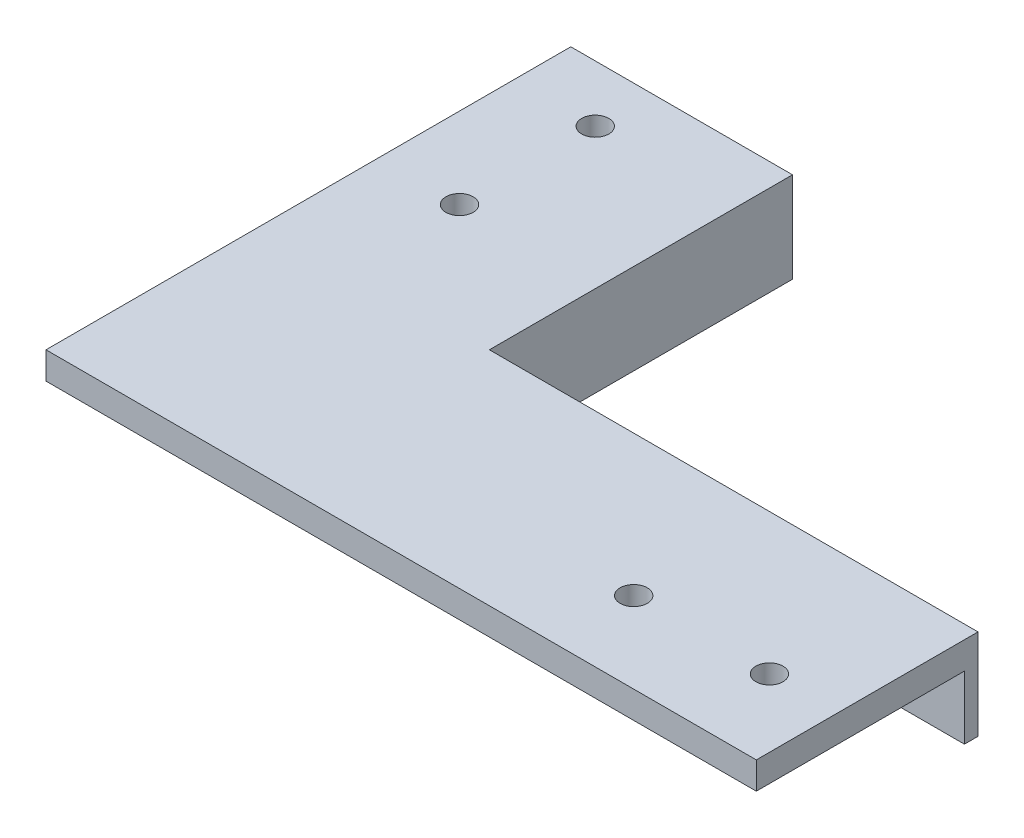
ISO-10303-21;
HEADER;
FILE_DESCRIPTION(('STEP AP214'),'2;1');
FILE_NAME('part.step','',(''),(''),'','','');
FILE_SCHEMA(('AUTOMOTIVE_DESIGN { 1 0 10303 214 1 1 1 1 }'));
ENDSEC;
DATA;
#1=APPLICATION_CONTEXT('core data for automotive mechanical design processes');
#2=APPLICATION_PROTOCOL_DEFINITION('international standard','automotive_design',2000,#1);
#3=PRODUCT_CONTEXT('',#1,'mechanical');
#4=PRODUCT('Part','Part','',(#3));
#5=PRODUCT_RELATED_PRODUCT_CATEGORY('part','',(#4));
#6=PRODUCT_DEFINITION_FORMATION('','',#4);
#7=PRODUCT_DEFINITION_CONTEXT('part definition',#1,'design');
#8=PRODUCT_DEFINITION('design','',#6,#7);
#9=PRODUCT_DEFINITION_SHAPE('','',#8);
#10=(LENGTH_UNIT() NAMED_UNIT(*) SI_UNIT(.MILLI.,.METRE.));
#11=(NAMED_UNIT(*) PLANE_ANGLE_UNIT() SI_UNIT($,.RADIAN.));
#12=(NAMED_UNIT(*) SI_UNIT($,.STERADIAN.) SOLID_ANGLE_UNIT());
#13=UNCERTAINTY_MEASURE_WITH_UNIT(LENGTH_MEASURE(1.E-05),#10,'distance_accuracy_value','');
#14=(GEOMETRIC_REPRESENTATION_CONTEXT(3) GLOBAL_UNCERTAINTY_ASSIGNED_CONTEXT((#13)) GLOBAL_UNIT_ASSIGNED_CONTEXT((#10,
#11,#12)) REPRESENTATION_CONTEXT('',''));
#15=CARTESIAN_POINT('',(0.,0.,0.));
#16=DIRECTION('',(0.,0.,1.));
#17=DIRECTION('',(1.,0.,0.));
#18=AXIS2_PLACEMENT_3D('',#15,#16,#17);
#19=CARTESIAN_POINT('',(-39.25,3.,29.));
#20=DIRECTION('',(0.,0.,-1.));
#21=DIRECTION('',(-1.,0.,0.));
#22=AXIS2_PLACEMENT_3D('',#19,#20,#21);
#23=PLANE('',#22);
#24=DIRECTION('',(1.,0.,0.));
#25=VECTOR('',#24,1.);
#26=CARTESIAN_POINT('',(-39.25,0.,29.));
#27=LINE('',#26,#25);
#28=CARTESIAN_POINT('',(-39.25,0.,29.));
#29=VERTEX_POINT('',#28);
#30=CARTESIAN_POINT('',(39.25,0.,29.));
#31=VERTEX_POINT('',#30);
#32=EDGE_CURVE('E182',#29,#31,#27,.T.);
#33=ORIENTED_EDGE('',*,*,#32,.T.);
#34=DIRECTION('',(0.,-1.,0.));
#35=VECTOR('',#34,1.);
#36=CARTESIAN_POINT('',(39.25,3.,29.));
#37=LINE('',#36,#35);
#38=CARTESIAN_POINT('',(39.25,3.,29.));
#39=VERTEX_POINT('',#38);
#40=EDGE_CURVE('E11',#39,#31,#37,.T.);
#41=ORIENTED_EDGE('',*,*,#40,.F.);
#42=DIRECTION('',(1.,0.,0.));
#43=VECTOR('',#42,1.);
#44=CARTESIAN_POINT('',(-39.25,3.,29.));
#45=LINE('',#44,#43);
#46=CARTESIAN_POINT('',(-39.25,3.,29.));
#47=VERTEX_POINT('',#46);
#48=EDGE_CURVE('E185',#47,#39,#45,.T.);
#49=ORIENTED_EDGE('',*,*,#48,.F.);
#50=DIRECTION('',(0.,-1.,0.));
#51=VECTOR('',#50,1.);
#52=CARTESIAN_POINT('',(-39.25,3.,29.));
#53=LINE('',#52,#51);
#54=EDGE_CURVE('E191',#47,#29,#53,.T.);
#55=ORIENTED_EDGE('',*,*,#54,.T.);
#56=EDGE_LOOP('',(#33,#41,#49,#55));
#57=FACE_BOUND('',#56,.T.);
#58=ADVANCED_FACE('F32',(#57),#23,.F.);
#59=CARTESIAN_POINT('',(39.25,3.,29.));
#60=DIRECTION('',(-1.,0.,0.));
#61=DIRECTION('',(0.,0.,1.));
#62=AXIS2_PLACEMENT_3D('',#59,#60,#61);
#63=PLANE('',#62);
#64=DIRECTION('',(0.,0.,-1.));
#65=VECTOR('',#64,1.);
#66=CARTESIAN_POINT('',(39.25,0.,29.));
#67=LINE('',#66,#65);
#68=CARTESIAN_POINT('',(39.25,0.,6.));
#69=VERTEX_POINT('',#68);
#70=EDGE_CURVE('E194',#31,#69,#67,.T.);
#71=ORIENTED_EDGE('',*,*,#70,.T.);
#72=DIRECTION('',(0.,1.,0.));
#73=VECTOR('',#72,1.);
#74=CARTESIAN_POINT('',(39.25,-7.,6.));
#75=LINE('',#74,#73);
#76=CARTESIAN_POINT('',(39.25,-7.,6.));
#77=VERTEX_POINT('',#76);
#78=EDGE_CURVE('E157',#77,#69,#75,.T.);
#79=ORIENTED_EDGE('',*,*,#78,.F.);
#80=DIRECTION('',(0.,0.,-1.));
#81=VECTOR('',#80,1.);
#82=CARTESIAN_POINT('',(39.25,-7.,6.));
#83=LINE('',#82,#81);
#84=CARTESIAN_POINT('',(39.25,-7.,4.5));
#85=VERTEX_POINT('',#84);
#86=EDGE_CURVE('E142',#77,#85,#83,.T.);
#87=ORIENTED_EDGE('',*,*,#86,.T.);
#88=DIRECTION('',(0.,1.,0.));
#89=VECTOR('',#88,1.);
#90=CARTESIAN_POINT('',(39.25,-7.,4.5));
#91=LINE('',#90,#89);
#92=CARTESIAN_POINT('',(39.25,3.,4.5));
#93=VERTEX_POINT('',#92);
#94=EDGE_CURVE('E155',#85,#93,#91,.T.);
#95=ORIENTED_EDGE('',*,*,#94,.T.);
#96=DIRECTION('',(0.,0.,-1.));
#97=VECTOR('',#96,1.);
#98=CARTESIAN_POINT('',(39.25,3.,29.));
#99=LINE('',#98,#97);
#100=EDGE_CURVE('E80',#39,#93,#99,.T.);
#101=ORIENTED_EDGE('',*,*,#100,.F.);
#102=ORIENTED_EDGE('',*,*,#40,.T.);
#103=EDGE_LOOP('',(#71,#79,#87,#95,#101,#102));
#104=FACE_BOUND('',#103,.T.);
#105=ADVANCED_FACE('F213',(#104),#63,.F.);
#106=CARTESIAN_POINT('',(-16.25,3.,-29.));
#107=DIRECTION('',(0.,0.,1.));
#108=DIRECTION('',(1.,0.,0.));
#109=AXIS2_PLACEMENT_3D('',#106,#107,#108);
#110=PLANE('',#109);
#111=DIRECTION('',(-1.,0.,0.));
#112=VECTOR('',#111,1.);
#113=CARTESIAN_POINT('',(-16.25,0.,-29.));
#114=LINE('',#113,#112);
#115=CARTESIAN_POINT('',(-16.25,0.,-29.));
#116=VERTEX_POINT('',#115);
#117=CARTESIAN_POINT('',(-39.25,0.,-29.));
#118=VERTEX_POINT('',#117);
#119=EDGE_CURVE('E69',#116,#118,#114,.T.);
#120=ORIENTED_EDGE('',*,*,#119,.T.);
#121=DIRECTION('',(0.,-1.,0.));
#122=VECTOR('',#121,1.);
#123=CARTESIAN_POINT('',(-39.25,3.,-29.));
#124=LINE('',#123,#122);
#125=CARTESIAN_POINT('',(-39.25,3.,-29.));
#126=VERTEX_POINT('',#125);
#127=EDGE_CURVE('E40',#126,#118,#124,.T.);
#128=ORIENTED_EDGE('',*,*,#127,.F.);
#129=DIRECTION('',(-1.,0.,0.));
#130=VECTOR('',#129,1.);
#131=CARTESIAN_POINT('',(-16.25,3.,-29.));
#132=LINE('',#131,#130);
#133=CARTESIAN_POINT('',(-14.75,3.,-29.));
#134=VERTEX_POINT('',#133);
#135=EDGE_CURVE('E188',#134,#126,#132,.T.);
#136=ORIENTED_EDGE('',*,*,#135,.F.);
#137=DIRECTION('',(0.,1.,0.));
#138=VECTOR('',#137,1.);
#139=CARTESIAN_POINT('',(-14.75,-7.,-29.));
#140=LINE('',#139,#138);
#141=CARTESIAN_POINT('',(-14.75,-7.,-29.));
#142=VERTEX_POINT('',#141);
#143=EDGE_CURVE('E134',#142,#134,#140,.T.);
#144=ORIENTED_EDGE('',*,*,#143,.F.);
#145=DIRECTION('',(-1.,0.,0.));
#146=VECTOR('',#145,1.);
#147=CARTESIAN_POINT('',(-14.75,-7.,-29.));
#148=LINE('',#147,#146);
#149=CARTESIAN_POINT('',(-16.25,-7.,-29.));
#150=VERTEX_POINT('',#149);
#151=EDGE_CURVE('E126',#142,#150,#148,.T.);
#152=ORIENTED_EDGE('',*,*,#151,.T.);
#153=DIRECTION('',(0.,1.,0.));
#154=VECTOR('',#153,1.);
#155=CARTESIAN_POINT('',(-16.25,-7.,-29.));
#156=LINE('',#155,#154);
#157=EDGE_CURVE('E111',#150,#116,#156,.T.);
#158=ORIENTED_EDGE('',*,*,#157,.T.);
#159=EDGE_LOOP('',(#120,#128,#136,#144,#152,#158));
#160=FACE_BOUND('',#159,.T.);
#161=ADVANCED_FACE('F132',(#160),#110,.F.);
#162=CARTESIAN_POINT('',(-39.25,3.,-29.));
#163=DIRECTION('',(1.,0.,0.));
#164=DIRECTION('',(0.,0.,-1.));
#165=AXIS2_PLACEMENT_3D('',#162,#163,#164);
#166=PLANE('',#165);
#167=DIRECTION('',(0.,0.,1.));
#168=VECTOR('',#167,1.);
#169=CARTESIAN_POINT('',(-39.25,0.,-29.));
#170=LINE('',#169,#168);
#171=EDGE_CURVE('E74',#118,#29,#170,.T.);
#172=ORIENTED_EDGE('',*,*,#171,.T.);
#173=ORIENTED_EDGE('',*,*,#54,.F.);
#174=DIRECTION('',(0.,0.,1.));
#175=VECTOR('',#174,1.);
#176=CARTESIAN_POINT('',(-39.25,3.,-29.));
#177=LINE('',#176,#175);
#178=EDGE_CURVE('E48',#126,#47,#177,.T.);
#179=ORIENTED_EDGE('',*,*,#178,.F.);
#180=ORIENTED_EDGE('',*,*,#127,.T.);
#181=EDGE_LOOP('',(#172,#173,#179,#180));
#182=FACE_BOUND('',#181,.T.);
#183=ADVANCED_FACE('F202',(#182),#166,.F.);
#184=CARTESIAN_POINT('',(0.,3.,0.));
#185=DIRECTION('',(0.,1.,0.));
#186=DIRECTION('',(0.,0.,1.));
#187=AXIS2_PLACEMENT_3D('',#184,#185,#186);
#188=PLANE('',#187);
#189=CARTESIAN_POINT('',(-30.3,3.,-7.75));
#190=DIRECTION('',(0.,1.,0.));
#191=DIRECTION('',(0.,0.,1.));
#192=AXIS2_PLACEMENT_3D('',#189,#190,#191);
#193=CIRCLE('',#192,1.5);
#194=CARTESIAN_POINT('',(-30.3,3.,-6.25));
#195=VERTEX_POINT('',#194);
#196=EDGE_CURVE('E152',#195,#195,#193,.T.);
#197=ORIENTED_EDGE('',*,*,#196,.F.);
#198=EDGE_LOOP('',(#197));
#199=FACE_BOUND('',#198,.T.);
#200=CARTESIAN_POINT('',(-30.3,3.,-22.75));
#201=DIRECTION('',(0.,1.,0.));
#202=DIRECTION('',(0.,0.,1.));
#203=AXIS2_PLACEMENT_3D('',#200,#201,#202);
#204=CIRCLE('',#203,1.5);
#205=CARTESIAN_POINT('',(-30.3,3.,-21.25));
#206=VERTEX_POINT('',#205);
#207=EDGE_CURVE('E164',#206,#206,#204,.T.);
#208=ORIENTED_EDGE('',*,*,#207,.F.);
#209=EDGE_LOOP('',(#208));
#210=FACE_BOUND('',#209,.T.);
#211=CARTESIAN_POINT('',(16.75,3.,20.05));
#212=DIRECTION('',(0.,1.,0.));
#213=DIRECTION('',(0.,0.,1.));
#214=AXIS2_PLACEMENT_3D('',#211,#212,#213);
#215=CIRCLE('',#214,1.5);
#216=CARTESIAN_POINT('',(16.75,3.,21.55));
#217=VERTEX_POINT('',#216);
#218=EDGE_CURVE('E170',#217,#217,#215,.T.);
#219=ORIENTED_EDGE('',*,*,#218,.F.);
#220=EDGE_LOOP('',(#219));
#221=FACE_BOUND('',#220,.T.);
#222=CARTESIAN_POINT('',(31.75,3.,20.05));
#223=DIRECTION('',(0.,1.,0.));
#224=DIRECTION('',(0.,0.,1.));
#225=AXIS2_PLACEMENT_3D('',#222,#223,#224);
#226=CIRCLE('',#225,1.5);
#227=CARTESIAN_POINT('',(31.75,3.,21.55));
#228=VERTEX_POINT('',#227);
#229=EDGE_CURVE('E176',#228,#228,#226,.T.);
#230=ORIENTED_EDGE('',*,*,#229,.F.);
#231=EDGE_LOOP('',(#230));
#232=FACE_BOUND('',#231,.T.);
#233=ORIENTED_EDGE('',*,*,#48,.T.);
#234=ORIENTED_EDGE('',*,*,#100,.T.);
#235=DIRECTION('',(-1.,0.,0.));
#236=VECTOR('',#235,1.);
#237=CARTESIAN_POINT('',(39.25,3.,4.5));
#238=LINE('',#237,#236);
#239=CARTESIAN_POINT('',(-14.75,3.,4.50000000000001));
#240=VERTEX_POINT('',#239);
#241=EDGE_CURVE('E138',#93,#240,#238,.T.);
#242=ORIENTED_EDGE('',*,*,#241,.T.);
#243=DIRECTION('',(0.,0.,-1.));
#244=VECTOR('',#243,1.);
#245=CARTESIAN_POINT('',(-14.75,3.,4.50000000000001));
#246=LINE('',#245,#244);
#247=EDGE_CURVE('E135',#240,#134,#246,.T.);
#248=ORIENTED_EDGE('',*,*,#247,.T.);
#249=ORIENTED_EDGE('',*,*,#135,.T.);
#250=ORIENTED_EDGE('',*,*,#178,.T.);
#251=EDGE_LOOP('',(#233,#234,#242,#248,#249,#250));
#252=FACE_BOUND('',#251,.T.);
#253=ADVANCED_FACE('F210',(#199,#210,#221,#232,#252),#188,.T.);
#254=CARTESIAN_POINT('',(0.,0.,0.));
#255=DIRECTION('',(0.,1.,0.));
#256=DIRECTION('',(0.,0.,1.));
#257=AXIS2_PLACEMENT_3D('',#254,#255,#256);
#258=PLANE('',#257);
#259=CARTESIAN_POINT('',(-30.3,0.,-7.75));
#260=DIRECTION('',(0.,1.,0.));
#261=DIRECTION('',(0.,0.,1.));
#262=AXIS2_PLACEMENT_3D('',#259,#260,#261);
#263=CIRCLE('',#262,1.5);
#264=CARTESIAN_POINT('',(-30.3,0.,-6.25));
#265=VERTEX_POINT('',#264);
#266=EDGE_CURVE('E161',#265,#265,#263,.T.);
#267=ORIENTED_EDGE('',*,*,#266,.T.);
#268=EDGE_LOOP('',(#267));
#269=FACE_BOUND('',#268,.T.);
#270=CARTESIAN_POINT('',(-30.3,0.,-22.75));
#271=DIRECTION('',(0.,1.,0.));
#272=DIRECTION('',(0.,0.,1.));
#273=AXIS2_PLACEMENT_3D('',#270,#271,#272);
#274=CIRCLE('',#273,1.5);
#275=CARTESIAN_POINT('',(-30.3,0.,-21.25));
#276=VERTEX_POINT('',#275);
#277=EDGE_CURVE('E167',#276,#276,#274,.T.);
#278=ORIENTED_EDGE('',*,*,#277,.T.);
#279=EDGE_LOOP('',(#278));
#280=FACE_BOUND('',#279,.T.);
#281=CARTESIAN_POINT('',(16.75,0.,20.05));
#282=DIRECTION('',(0.,1.,0.));
#283=DIRECTION('',(0.,0.,1.));
#284=AXIS2_PLACEMENT_3D('',#281,#282,#283);
#285=CIRCLE('',#284,1.5);
#286=CARTESIAN_POINT('',(16.75,0.,21.55));
#287=VERTEX_POINT('',#286);
#288=EDGE_CURVE('E173',#287,#287,#285,.T.);
#289=ORIENTED_EDGE('',*,*,#288,.T.);
#290=EDGE_LOOP('',(#289));
#291=FACE_BOUND('',#290,.T.);
#292=CARTESIAN_POINT('',(31.75,0.,20.05));
#293=DIRECTION('',(0.,1.,0.));
#294=DIRECTION('',(0.,0.,1.));
#295=AXIS2_PLACEMENT_3D('',#292,#293,#294);
#296=CIRCLE('',#295,1.5);
#297=CARTESIAN_POINT('',(31.75,0.,21.55));
#298=VERTEX_POINT('',#297);
#299=EDGE_CURVE('E179',#298,#298,#296,.T.);
#300=ORIENTED_EDGE('',*,*,#299,.T.);
#301=EDGE_LOOP('',(#300));
#302=FACE_BOUND('',#301,.T.);
#303=ORIENTED_EDGE('',*,*,#32,.F.);
#304=ORIENTED_EDGE('',*,*,#171,.F.);
#305=ORIENTED_EDGE('',*,*,#119,.F.);
#306=DIRECTION('',(0.,0.,-1.));
#307=VECTOR('',#306,1.);
#308=CARTESIAN_POINT('',(-16.25,0.,-29.));
#309=LINE('',#308,#307);
#310=CARTESIAN_POINT('',(-16.25,0.,6.));
#311=VERTEX_POINT('',#310);
#312=EDGE_CURVE('E116',#311,#116,#309,.T.);
#313=ORIENTED_EDGE('',*,*,#312,.F.);
#314=DIRECTION('',(-1.,0.,0.));
#315=VECTOR('',#314,1.);
#316=CARTESIAN_POINT('',(-16.25,0.,6.));
#317=LINE('',#316,#315);
#318=EDGE_CURVE('E196',#69,#311,#317,.T.);
#319=ORIENTED_EDGE('',*,*,#318,.F.);
#320=ORIENTED_EDGE('',*,*,#70,.F.);
#321=EDGE_LOOP('',(#303,#304,#305,#313,#319,#320));
#322=FACE_BOUND('',#321,.T.);
#323=ADVANCED_FACE('F205',(#269,#280,#291,#302,#322),#258,.F.);
#324=CARTESIAN_POINT('',(31.75,0.,20.05));
#325=DIRECTION('',(0.,1.,0.));
#326=DIRECTION('',(0.,0.,1.));
#327=AXIS2_PLACEMENT_3D('',#324,#325,#326);
#328=CYLINDRICAL_SURFACE('',#327,1.5);
#329=ORIENTED_EDGE('',*,*,#299,.F.);
#330=EDGE_LOOP('',(#329));
#331=FACE_BOUND('',#330,.T.);
#332=ORIENTED_EDGE('',*,*,#229,.T.);
#333=EDGE_LOOP('',(#332));
#334=FACE_BOUND('',#333,.T.);
#335=ADVANCED_FACE('F246',(#331,#334),#328,.F.);
#336=CARTESIAN_POINT('',(16.75,0.,20.05));
#337=DIRECTION('',(0.,1.,0.));
#338=DIRECTION('',(0.,0.,1.));
#339=AXIS2_PLACEMENT_3D('',#336,#337,#338);
#340=CYLINDRICAL_SURFACE('',#339,1.5);
#341=ORIENTED_EDGE('',*,*,#288,.F.);
#342=EDGE_LOOP('',(#341));
#343=FACE_BOUND('',#342,.T.);
#344=ORIENTED_EDGE('',*,*,#218,.T.);
#345=EDGE_LOOP('',(#344));
#346=FACE_BOUND('',#345,.T.);
#347=ADVANCED_FACE('F253',(#343,#346),#340,.F.);
#348=CARTESIAN_POINT('',(-30.3,0.,-22.75));
#349=DIRECTION('',(0.,1.,0.));
#350=DIRECTION('',(0.,0.,1.));
#351=AXIS2_PLACEMENT_3D('',#348,#349,#350);
#352=CYLINDRICAL_SURFACE('',#351,1.5);
#353=ORIENTED_EDGE('',*,*,#277,.F.);
#354=EDGE_LOOP('',(#353));
#355=FACE_BOUND('',#354,.T.);
#356=ORIENTED_EDGE('',*,*,#207,.T.);
#357=EDGE_LOOP('',(#356));
#358=FACE_BOUND('',#357,.T.);
#359=ADVANCED_FACE('F229',(#355,#358),#352,.F.);
#360=CARTESIAN_POINT('',(-30.3,0.,-7.75));
#361=DIRECTION('',(0.,1.,0.));
#362=DIRECTION('',(0.,0.,1.));
#363=AXIS2_PLACEMENT_3D('',#360,#361,#362);
#364=CYLINDRICAL_SURFACE('',#363,1.5);
#365=ORIENTED_EDGE('',*,*,#266,.F.);
#366=EDGE_LOOP('',(#365));
#367=FACE_BOUND('',#366,.T.);
#368=ORIENTED_EDGE('',*,*,#196,.T.);
#369=EDGE_LOOP('',(#368));
#370=FACE_BOUND('',#369,.T.);
#371=ADVANCED_FACE('F222',(#367,#370),#364,.F.);
#372=CARTESIAN_POINT('',(-16.25,-7.,6.));
#373=DIRECTION('',(0.,0.,1.));
#374=DIRECTION('',(1.,0.,0.));
#375=AXIS2_PLACEMENT_3D('',#372,#373,#374);
#376=PLANE('',#375);
#377=ORIENTED_EDGE('',*,*,#318,.T.);
#378=DIRECTION('',(0.,1.,0.));
#379=VECTOR('',#378,1.);
#380=CARTESIAN_POINT('',(-16.25,-7.,6.));
#381=LINE('',#380,#379);
#382=CARTESIAN_POINT('',(-16.25,-7.,6.));
#383=VERTEX_POINT('',#382);
#384=EDGE_CURVE('E118',#383,#311,#381,.T.);
#385=ORIENTED_EDGE('',*,*,#384,.F.);
#386=DIRECTION('',(1.,0.,0.));
#387=VECTOR('',#386,1.);
#388=CARTESIAN_POINT('',(-16.25,-7.,6.));
#389=LINE('',#388,#387);
#390=EDGE_CURVE('E130',#383,#77,#389,.T.);
#391=ORIENTED_EDGE('',*,*,#390,.T.);
#392=ORIENTED_EDGE('',*,*,#78,.T.);
#393=EDGE_LOOP('',(#377,#385,#391,#392));
#394=FACE_BOUND('',#393,.T.);
#395=ADVANCED_FACE('F220',(#394),#376,.T.);
#396=CARTESIAN_POINT('',(-16.25,-7.,-29.));
#397=DIRECTION('',(-1.,0.,0.));
#398=DIRECTION('',(0.,0.,1.));
#399=AXIS2_PLACEMENT_3D('',#396,#397,#398);
#400=PLANE('',#399);
#401=ORIENTED_EDGE('',*,*,#312,.T.);
#402=ORIENTED_EDGE('',*,*,#157,.F.);
#403=DIRECTION('',(0.,0.,1.));
#404=VECTOR('',#403,1.);
#405=CARTESIAN_POINT('',(-16.25,-7.,-29.));
#406=LINE('',#405,#404);
#407=EDGE_CURVE('E115',#150,#383,#406,.T.);
#408=ORIENTED_EDGE('',*,*,#407,.T.);
#409=ORIENTED_EDGE('',*,*,#384,.T.);
#410=EDGE_LOOP('',(#401,#402,#408,#409));
#411=FACE_BOUND('',#410,.T.);
#412=ADVANCED_FACE('F113',(#411),#400,.T.);
#413=CARTESIAN_POINT('',(-14.75,-7.,4.50000000000001));
#414=DIRECTION('',(1.,0.,0.));
#415=DIRECTION('',(0.,0.,-1.));
#416=AXIS2_PLACEMENT_3D('',#413,#414,#415);
#417=PLANE('',#416);
#418=ORIENTED_EDGE('',*,*,#247,.F.);
#419=DIRECTION('',(0.,1.,0.));
#420=VECTOR('',#419,1.);
#421=CARTESIAN_POINT('',(-14.75,-7.,4.50000000000001));
#422=LINE('',#421,#420);
#423=CARTESIAN_POINT('',(-14.75,-7.,4.50000000000001));
#424=VERTEX_POINT('',#423);
#425=EDGE_CURVE('E153',#424,#240,#422,.T.);
#426=ORIENTED_EDGE('',*,*,#425,.F.);
#427=DIRECTION('',(0.,0.,-1.));
#428=VECTOR('',#427,1.);
#429=CARTESIAN_POINT('',(-14.75,-7.,4.50000000000001));
#430=LINE('',#429,#428);
#431=EDGE_CURVE('E119',#424,#142,#430,.T.);
#432=ORIENTED_EDGE('',*,*,#431,.T.);
#433=ORIENTED_EDGE('',*,*,#143,.T.);
#434=EDGE_LOOP('',(#418,#426,#432,#433));
#435=FACE_BOUND('',#434,.T.);
#436=ADVANCED_FACE('F218',(#435),#417,.T.);
#437=CARTESIAN_POINT('',(39.25,-7.,4.5));
#438=DIRECTION('',(0.,0.,-1.));
#439=DIRECTION('',(-1.,0.,0.));
#440=AXIS2_PLACEMENT_3D('',#437,#438,#439);
#441=PLANE('',#440);
#442=ORIENTED_EDGE('',*,*,#241,.F.);
#443=ORIENTED_EDGE('',*,*,#94,.F.);
#444=DIRECTION('',(-1.,0.,0.));
#445=VECTOR('',#444,1.);
#446=CARTESIAN_POINT('',(39.25,-7.,4.5));
#447=LINE('',#446,#445);
#448=EDGE_CURVE('E145',#85,#424,#447,.T.);
#449=ORIENTED_EDGE('',*,*,#448,.T.);
#450=ORIENTED_EDGE('',*,*,#425,.T.);
#451=EDGE_LOOP('',(#442,#443,#449,#450));
#452=FACE_BOUND('',#451,.T.);
#453=ADVANCED_FACE('F216',(#452),#441,.T.);
#454=CARTESIAN_POINT('',(0.,-7.,0.));
#455=DIRECTION('',(0.,1.,0.));
#456=DIRECTION('',(0.,0.,1.));
#457=AXIS2_PLACEMENT_3D('',#454,#455,#456);
#458=PLANE('',#457);
#459=ORIENTED_EDGE('',*,*,#151,.F.);
#460=ORIENTED_EDGE('',*,*,#431,.F.);
#461=ORIENTED_EDGE('',*,*,#448,.F.);
#462=ORIENTED_EDGE('',*,*,#86,.F.);
#463=ORIENTED_EDGE('',*,*,#390,.F.);
#464=ORIENTED_EDGE('',*,*,#407,.F.);
#465=EDGE_LOOP('',(#459,#460,#461,#462,#463,#464));
#466=FACE_BOUND('',#465,.T.);
#467=ADVANCED_FACE('F124',(#466),#458,.F.);
#468=CLOSED_SHELL('',(#58,#105,#161,#183,#253,#323,#335,#347,#359,#371,#395,#412,#436,#453,#467));
#469=MANIFOLD_SOLID_BREP('B2',#468);
#470=ADVANCED_BREP_SHAPE_REPRESENTATION('',(#18,#469),#14);
#471=SHAPE_DEFINITION_REPRESENTATION(#9,#470);
ENDSEC;
END-ISO-10303-21;
